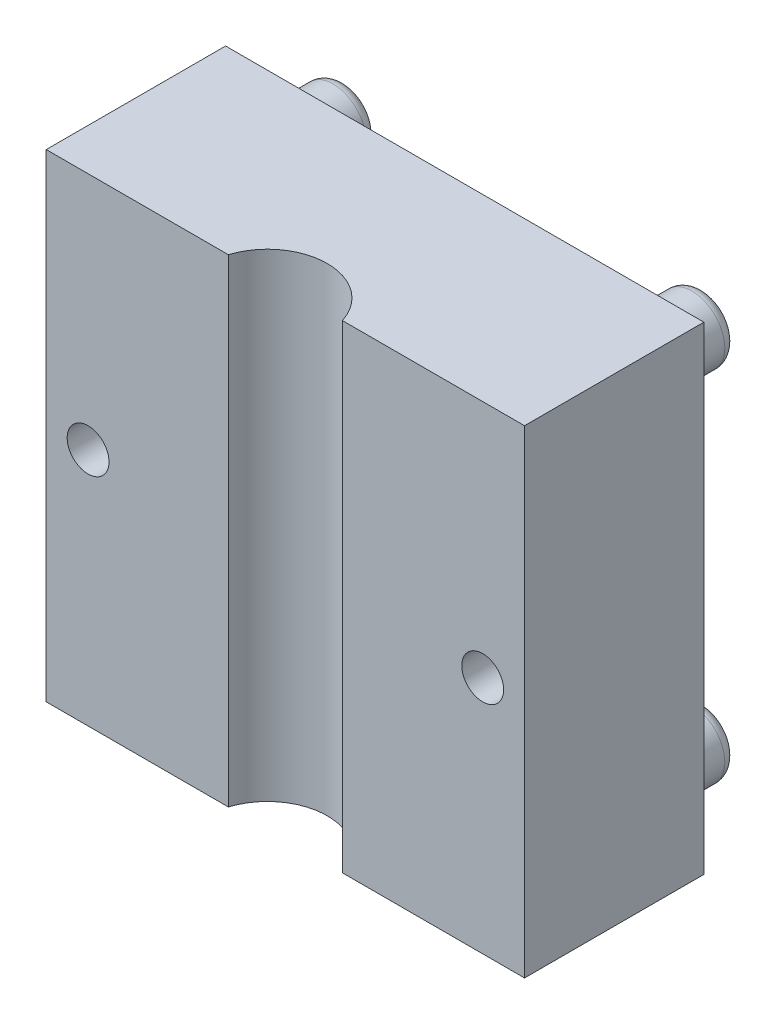
ISO-10303-21;
HEADER;
FILE_DESCRIPTION(('STEP AP214'),'2;1');
FILE_NAME('part.step','',(''),(''),'','','');
FILE_SCHEMA(('AUTOMOTIVE_DESIGN { 1 0 10303 214 1 1 1 1 }'));
ENDSEC;
DATA;
#1=APPLICATION_CONTEXT('core data for automotive mechanical design processes');
#2=APPLICATION_PROTOCOL_DEFINITION('international standard','automotive_design',2000,#1);
#3=PRODUCT_CONTEXT('',#1,'mechanical');
#4=PRODUCT('Part','Part','',(#3));
#5=PRODUCT_RELATED_PRODUCT_CATEGORY('part','',(#4));
#6=PRODUCT_DEFINITION_FORMATION('','',#4);
#7=PRODUCT_DEFINITION_CONTEXT('part definition',#1,'design');
#8=PRODUCT_DEFINITION('design','',#6,#7);
#9=PRODUCT_DEFINITION_SHAPE('','',#8);
#10=(LENGTH_UNIT() NAMED_UNIT(*) SI_UNIT(.MILLI.,.METRE.));
#11=(NAMED_UNIT(*) PLANE_ANGLE_UNIT() SI_UNIT($,.RADIAN.));
#12=(NAMED_UNIT(*) SI_UNIT($,.STERADIAN.) SOLID_ANGLE_UNIT());
#13=UNCERTAINTY_MEASURE_WITH_UNIT(LENGTH_MEASURE(1.E-05),#10,'distance_accuracy_value','');
#14=(GEOMETRIC_REPRESENTATION_CONTEXT(3) GLOBAL_UNCERTAINTY_ASSIGNED_CONTEXT((#13)) GLOBAL_UNIT_ASSIGNED_CONTEXT((#10,
#11,#12)) REPRESENTATION_CONTEXT('',''));
#15=CARTESIAN_POINT('',(0.,0.,0.));
#16=DIRECTION('',(0.,0.,1.));
#17=DIRECTION('',(1.,0.,0.));
#18=AXIS2_PLACEMENT_3D('',#15,#16,#17);
#19=CARTESIAN_POINT('',(0.,0.,15.));
#20=DIRECTION('',(0.,0.,1.));
#21=DIRECTION('',(1.,0.,0.));
#22=AXIS2_PLACEMENT_3D('',#19,#20,#21);
#23=PLANE('',#22);
#24=CARTESIAN_POINT('',(16.5,0.,15.));
#25=DIRECTION('',(0.,0.,-1.));
#26=DIRECTION('',(-1.,0.,0.));
#27=AXIS2_PLACEMENT_3D('',#24,#25,#26);
#28=CIRCLE('',#27,1.75);
#29=CARTESIAN_POINT('',(14.75,0.,15.));
#30=VERTEX_POINT('',#29);
#31=EDGE_CURVE('E184',#30,#30,#28,.T.);
#32=ORIENTED_EDGE('',*,*,#31,.T.);
#33=EDGE_LOOP('',(#32));
#34=FACE_BOUND('',#33,.T.);
#35=DIRECTION('',(0.,1.,0.));
#36=VECTOR('',#35,1.);
#37=CARTESIAN_POINT('',(4.76969600708473,-20.,15.));
#38=LINE('',#37,#36);
#39=CARTESIAN_POINT('',(4.76969600708473,-20.,15.));
#40=VERTEX_POINT('',#39);
#41=CARTESIAN_POINT('',(4.76969600708473,20.,15.));
#42=VERTEX_POINT('',#41);
#43=EDGE_CURVE('E11',#40,#42,#38,.T.);
#44=ORIENTED_EDGE('',*,*,#43,.F.);
#45=DIRECTION('',(1.,0.,0.));
#46=VECTOR('',#45,1.);
#47=CARTESIAN_POINT('',(-20.,-20.,15.));
#48=LINE('',#47,#46);
#49=CARTESIAN_POINT('',(20.,-20.,15.));
#50=VERTEX_POINT('',#49);
#51=EDGE_CURVE('E58',#40,#50,#48,.T.);
#52=ORIENTED_EDGE('',*,*,#51,.T.);
#53=DIRECTION('',(0.,1.,0.));
#54=VECTOR('',#53,1.);
#55=CARTESIAN_POINT('',(20.,20.,15.));
#56=LINE('',#55,#54);
#57=CARTESIAN_POINT('',(20.,20.,15.));
#58=VERTEX_POINT('',#57);
#59=EDGE_CURVE('E105',#50,#58,#56,.T.);
#60=ORIENTED_EDGE('',*,*,#59,.T.);
#61=DIRECTION('',(-1.,0.,0.));
#62=VECTOR('',#61,1.);
#63=CARTESIAN_POINT('',(-20.,20.,15.));
#64=LINE('',#63,#62);
#65=EDGE_CURVE('E87',#58,#42,#64,.T.);
#66=ORIENTED_EDGE('',*,*,#65,.T.);
#67=EDGE_LOOP('',(#44,#52,#60,#66));
#68=FACE_BOUND('',#67,.T.);
#69=ADVANCED_FACE('F33',(#34,#68),#23,.T.);
#70=CARTESIAN_POINT('',(0.,0.,0.));
#71=DIRECTION('',(0.,0.,1.));
#72=DIRECTION('',(1.,0.,0.));
#73=AXIS2_PLACEMENT_3D('',#70,#71,#72);
#74=PLANE('',#73);
#75=CARTESIAN_POINT('',(-16.5,0.,0.));
#76=DIRECTION('',(0.,0.,-1.));
#77=DIRECTION('',(-1.,0.,0.));
#78=AXIS2_PLACEMENT_3D('',#75,#76,#77);
#79=CIRCLE('',#78,3.);
#80=CARTESIAN_POINT('',(-19.5,0.,0.));
#81=VERTEX_POINT('',#80);
#82=EDGE_CURVE('E172',#81,#81,#79,.T.);
#83=ORIENTED_EDGE('',*,*,#82,.F.);
#84=EDGE_LOOP('',(#83));
#85=FACE_BOUND('',#84,.T.);
#86=CARTESIAN_POINT('',(16.5,0.,0.));
#87=DIRECTION('',(0.,0.,-1.));
#88=DIRECTION('',(-1.,0.,0.));
#89=AXIS2_PLACEMENT_3D('',#86,#87,#88);
#90=CIRCLE('',#89,3.);
#91=CARTESIAN_POINT('',(13.5,0.,0.));
#92=VERTEX_POINT('',#91);
#93=EDGE_CURVE('E188',#92,#92,#90,.T.);
#94=ORIENTED_EDGE('',*,*,#93,.F.);
#95=EDGE_LOOP('',(#94));
#96=FACE_BOUND('',#95,.T.);
#97=CARTESIAN_POINT('',(0.,0.,0.));
#98=DIRECTION('',(0.,0.,-1.));
#99=DIRECTION('',(-1.,0.,0.));
#100=AXIS2_PLACEMENT_3D('',#97,#98,#99);
#101=CIRCLE('',#100,12.5);
#102=CARTESIAN_POINT('',(-12.5,0.,0.));
#103=VERTEX_POINT('',#102);
#104=EDGE_CURVE('E194',#103,#103,#101,.T.);
#105=ORIENTED_EDGE('',*,*,#104,.F.);
#106=EDGE_LOOP('',(#105));
#107=FACE_BOUND('',#106,.T.);
#108=CARTESIAN_POINT('',(15.,-15.,0.));
#109=DIRECTION('',(0.,0.,1.));
#110=DIRECTION('',(1.,0.,0.));
#111=AXIS2_PLACEMENT_3D('',#108,#109,#110);
#112=CIRCLE('',#111,2.75);
#113=CARTESIAN_POINT('',(17.75,-15.,0.));
#114=VERTEX_POINT('',#113);
#115=EDGE_CURVE('E140',#114,#114,#112,.F.);
#116=ORIENTED_EDGE('',*,*,#115,.F.);
#117=EDGE_LOOP('',(#116));
#118=FACE_BOUND('',#117,.T.);
#119=CARTESIAN_POINT('',(15.,15.,0.));
#120=DIRECTION('',(0.,0.,1.));
#121=DIRECTION('',(1.,0.,0.));
#122=AXIS2_PLACEMENT_3D('',#119,#120,#121);
#123=CIRCLE('',#122,2.75);
#124=CARTESIAN_POINT('',(17.75,15.,0.));
#125=VERTEX_POINT('',#124);
#126=EDGE_CURVE('E134',#125,#125,#123,.F.);
#127=ORIENTED_EDGE('',*,*,#126,.F.);
#128=EDGE_LOOP('',(#127));
#129=FACE_BOUND('',#128,.T.);
#130=DIRECTION('',(0.,1.,0.));
#131=VECTOR('',#130,1.);
#132=CARTESIAN_POINT('',(20.,20.,0.));
#133=LINE('',#132,#131);
#134=CARTESIAN_POINT('',(20.,-20.,0.));
#135=VERTEX_POINT('',#134);
#136=CARTESIAN_POINT('',(20.,20.,0.));
#137=VERTEX_POINT('',#136);
#138=EDGE_CURVE('E117',#135,#137,#133,.T.);
#139=ORIENTED_EDGE('',*,*,#138,.F.);
#140=DIRECTION('',(1.,0.,0.));
#141=VECTOR('',#140,1.);
#142=CARTESIAN_POINT('',(-20.,-20.,0.));
#143=LINE('',#142,#141);
#144=CARTESIAN_POINT('',(-20.,-20.,0.));
#145=VERTEX_POINT('',#144);
#146=EDGE_CURVE('E80',#145,#135,#143,.T.);
#147=ORIENTED_EDGE('',*,*,#146,.F.);
#148=DIRECTION('',(0.,-1.,0.));
#149=VECTOR('',#148,1.);
#150=CARTESIAN_POINT('',(-20.,20.,0.));
#151=LINE('',#150,#149);
#152=CARTESIAN_POINT('',(-20.,20.,0.));
#153=VERTEX_POINT('',#152);
#154=EDGE_CURVE('E123',#153,#145,#151,.T.);
#155=ORIENTED_EDGE('',*,*,#154,.F.);
#156=DIRECTION('',(-1.,0.,0.));
#157=VECTOR('',#156,1.);
#158=CARTESIAN_POINT('',(-20.,20.,0.));
#159=LINE('',#158,#157);
#160=EDGE_CURVE('E120',#137,#153,#159,.T.);
#161=ORIENTED_EDGE('',*,*,#160,.F.);
#162=EDGE_LOOP('',(#139,#147,#155,#161));
#163=FACE_BOUND('',#162,.T.);
#164=CARTESIAN_POINT('',(-15.,15.,0.));
#165=DIRECTION('',(0.,0.,1.));
#166=DIRECTION('',(1.,0.,0.));
#167=AXIS2_PLACEMENT_3D('',#164,#165,#166);
#168=CIRCLE('',#167,2.75);
#169=CARTESIAN_POINT('',(-12.25,15.,0.));
#170=VERTEX_POINT('',#169);
#171=EDGE_CURVE('E137',#170,#170,#168,.F.);
#172=ORIENTED_EDGE('',*,*,#171,.F.);
#173=EDGE_LOOP('',(#172));
#174=FACE_BOUND('',#173,.T.);
#175=CARTESIAN_POINT('',(-15.,-15.,0.));
#176=DIRECTION('',(0.,0.,1.));
#177=DIRECTION('',(1.,0.,0.));
#178=AXIS2_PLACEMENT_3D('',#175,#176,#177);
#179=CIRCLE('',#178,2.74999999999999);
#180=CARTESIAN_POINT('',(-12.25,-15.,0.));
#181=VERTEX_POINT('',#180);
#182=EDGE_CURVE('E143',#181,#181,#179,.F.);
#183=ORIENTED_EDGE('',*,*,#182,.F.);
#184=EDGE_LOOP('',(#183));
#185=FACE_BOUND('',#184,.T.);
#186=ADVANCED_FACE('F202',(#85,#96,#107,#118,#129,#163,#174,#185),#74,.F.);
#187=CARTESIAN_POINT('',(20.,20.,15.));
#188=DIRECTION('',(-1.,0.,0.));
#189=DIRECTION('',(0.,-1.,0.));
#190=AXIS2_PLACEMENT_3D('',#187,#188,#189);
#191=PLANE('',#190);
#192=ORIENTED_EDGE('',*,*,#138,.T.);
#193=DIRECTION('',(0.,0.,-1.));
#194=VECTOR('',#193,1.);
#195=CARTESIAN_POINT('',(20.,20.,15.));
#196=LINE('',#195,#194);
#197=EDGE_CURVE('E132',#58,#137,#196,.T.);
#198=ORIENTED_EDGE('',*,*,#197,.F.);
#199=ORIENTED_EDGE('',*,*,#59,.F.);
#200=DIRECTION('',(0.,0.,-1.));
#201=VECTOR('',#200,1.);
#202=CARTESIAN_POINT('',(20.,-20.,15.));
#203=LINE('',#202,#201);
#204=EDGE_CURVE('E116',#50,#135,#203,.T.);
#205=ORIENTED_EDGE('',*,*,#204,.T.);
#206=EDGE_LOOP('',(#192,#198,#199,#205));
#207=FACE_BOUND('',#206,.T.);
#208=ADVANCED_FACE('F205',(#207),#191,.F.);
#209=CARTESIAN_POINT('',(-20.,20.,15.));
#210=DIRECTION('',(0.,-1.,0.));
#211=DIRECTION('',(0.,0.,-1.));
#212=AXIS2_PLACEMENT_3D('',#209,#210,#211);
#213=PLANE('',#212);
#214=CARTESIAN_POINT('',(-4.76969600708474,20.,15.));
#215=VERTEX_POINT('',#214);
#216=CARTESIAN_POINT('',(-20.,20.,15.));
#217=VERTEX_POINT('',#216);
#218=EDGE_CURVE('E101',#215,#217,#64,.T.);
#219=ORIENTED_EDGE('',*,*,#218,.F.);
#220=CARTESIAN_POINT('',(0.,20.,16.5));
#221=DIRECTION('',(0.,1.,0.));
#222=DIRECTION('',(0.,0.,1.));
#223=AXIS2_PLACEMENT_3D('',#220,#221,#222);
#224=CIRCLE('',#223,5.);
#225=EDGE_CURVE('E49',#42,#215,#224,.T.);
#226=ORIENTED_EDGE('',*,*,#225,.F.);
#227=ORIENTED_EDGE('',*,*,#65,.F.);
#228=ORIENTED_EDGE('',*,*,#197,.T.);
#229=ORIENTED_EDGE('',*,*,#160,.T.);
#230=DIRECTION('',(0.,0.,-1.));
#231=VECTOR('',#230,1.);
#232=CARTESIAN_POINT('',(-20.,20.,15.));
#233=LINE('',#232,#231);
#234=EDGE_CURVE('E129',#217,#153,#233,.T.);
#235=ORIENTED_EDGE('',*,*,#234,.F.);
#236=EDGE_LOOP('',(#219,#226,#227,#228,#229,#235));
#237=FACE_BOUND('',#236,.T.);
#238=ADVANCED_FACE('F99',(#237),#213,.F.);
#239=CARTESIAN_POINT('',(-20.,20.,15.));
#240=DIRECTION('',(1.,0.,0.));
#241=DIRECTION('',(0.,1.,0.));
#242=AXIS2_PLACEMENT_3D('',#239,#240,#241);
#243=PLANE('',#242);
#244=ORIENTED_EDGE('',*,*,#154,.T.);
#245=DIRECTION('',(0.,0.,-1.));
#246=VECTOR('',#245,1.);
#247=CARTESIAN_POINT('',(-20.,-20.,15.));
#248=LINE('',#247,#246);
#249=CARTESIAN_POINT('',(-20.,-20.,15.));
#250=VERTEX_POINT('',#249);
#251=EDGE_CURVE('E127',#250,#145,#248,.T.);
#252=ORIENTED_EDGE('',*,*,#251,.F.);
#253=DIRECTION('',(0.,-1.,0.));
#254=VECTOR('',#253,1.);
#255=CARTESIAN_POINT('',(-20.,20.,15.));
#256=LINE('',#255,#254);
#257=EDGE_CURVE('E107',#217,#250,#256,.T.);
#258=ORIENTED_EDGE('',*,*,#257,.F.);
#259=ORIENTED_EDGE('',*,*,#234,.T.);
#260=EDGE_LOOP('',(#244,#252,#258,#259));
#261=FACE_BOUND('',#260,.T.);
#262=ADVANCED_FACE('F251',(#261),#243,.F.);
#263=CARTESIAN_POINT('',(-20.,-20.,15.));
#264=DIRECTION('',(0.,1.,0.));
#265=DIRECTION('',(0.,0.,1.));
#266=AXIS2_PLACEMENT_3D('',#263,#264,#265);
#267=PLANE('',#266);
#268=ORIENTED_EDGE('',*,*,#51,.F.);
#269=CARTESIAN_POINT('',(0.,-20.,16.5));
#270=DIRECTION('',(0.,1.,0.));
#271=DIRECTION('',(0.,0.,1.));
#272=AXIS2_PLACEMENT_3D('',#269,#270,#271);
#273=CIRCLE('',#272,5.);
#274=CARTESIAN_POINT('',(-4.76969600708474,-20.,15.));
#275=VERTEX_POINT('',#274);
#276=EDGE_CURVE('E97',#40,#275,#273,.T.);
#277=ORIENTED_EDGE('',*,*,#276,.T.);
#278=EDGE_CURVE('E113',#250,#275,#48,.T.);
#279=ORIENTED_EDGE('',*,*,#278,.F.);
#280=ORIENTED_EDGE('',*,*,#251,.T.);
#281=ORIENTED_EDGE('',*,*,#146,.T.);
#282=ORIENTED_EDGE('',*,*,#204,.F.);
#283=EDGE_LOOP('',(#268,#277,#279,#280,#281,#282));
#284=FACE_BOUND('',#283,.T.);
#285=ADVANCED_FACE('F244',(#284),#267,.F.);
#286=CARTESIAN_POINT('',(-16.5,0.,15.));
#287=DIRECTION('',(0.,0.,-1.));
#288=DIRECTION('',(-1.,0.,0.));
#289=AXIS2_PLACEMENT_3D('',#286,#287,#288);
#290=CIRCLE('',#289,1.75);
#291=CARTESIAN_POINT('',(-18.25,0.,15.));
#292=VERTEX_POINT('',#291);
#293=EDGE_CURVE('E173',#292,#292,#290,.T.);
#294=ORIENTED_EDGE('',*,*,#293,.T.);
#295=EDGE_LOOP('',(#294));
#296=FACE_BOUND('',#295,.T.);
#297=DIRECTION('',(0.,1.,0.));
#298=VECTOR('',#297,1.);
#299=CARTESIAN_POINT('',(-4.76969600708474,-20.,15.));
#300=LINE('',#299,#298);
#301=EDGE_CURVE('E42',#215,#275,#300,.F.);
#302=ORIENTED_EDGE('',*,*,#301,.F.);
#303=ORIENTED_EDGE('',*,*,#218,.T.);
#304=ORIENTED_EDGE('',*,*,#257,.T.);
#305=ORIENTED_EDGE('',*,*,#278,.T.);
#306=EDGE_LOOP('',(#302,#303,#304,#305));
#307=FACE_BOUND('',#306,.T.);
#308=ADVANCED_FACE('F237',(#296,#307),#23,.T.);
#309=CARTESIAN_POINT('',(15.,15.,-5.));
#310=DIRECTION('',(0.,0.,1.));
#311=DIRECTION('',(1.,0.,0.));
#312=AXIS2_PLACEMENT_3D('',#309,#310,#311);
#313=CYLINDRICAL_SURFACE('',#312,2.75);
#314=CARTESIAN_POINT('',(15.,15.,-4.));
#315=DIRECTION('',(0.,0.,-1.));
#316=DIRECTION('',(-1.,0.,0.));
#317=AXIS2_PLACEMENT_3D('',#314,#315,#316);
#318=CIRCLE('',#317,2.75);
#319=CARTESIAN_POINT('',(12.25,15.,-4.));
#320=VERTEX_POINT('',#319);
#321=EDGE_CURVE('E167',#320,#320,#318,.F.);
#322=ORIENTED_EDGE('',*,*,#321,.T.);
#323=EDGE_LOOP('',(#322));
#324=FACE_BOUND('',#323,.T.);
#325=ORIENTED_EDGE('',*,*,#126,.T.);
#326=EDGE_LOOP('',(#325));
#327=FACE_BOUND('',#326,.T.);
#328=ADVANCED_FACE('F243',(#324,#327),#313,.T.);
#329=CARTESIAN_POINT('',(15.,15.,-5.));
#330=DIRECTION('',(0.,0.,-1.));
#331=DIRECTION('',(-1.,0.,0.));
#332=AXIS2_PLACEMENT_3D('',#329,#330,#331);
#333=PLANE('',#332);
#334=CARTESIAN_POINT('',(15.,15.,-5.));
#335=DIRECTION('',(0.,0.,-1.));
#336=DIRECTION('',(-1.,0.,0.));
#337=AXIS2_PLACEMENT_3D('',#334,#335,#336);
#338=CIRCLE('',#337,1.75);
#339=CARTESIAN_POINT('',(13.25,15.,-5.));
#340=VERTEX_POINT('',#339);
#341=EDGE_CURVE('E164',#340,#340,#338,.T.);
#342=ORIENTED_EDGE('',*,*,#341,.T.);
#343=EDGE_LOOP('',(#342));
#344=FACE_BOUND('',#343,.T.);
#345=ADVANCED_FACE('F249',(#344),#333,.T.);
#346=CARTESIAN_POINT('',(-15.,15.,-5.));
#347=DIRECTION('',(0.,0.,1.));
#348=DIRECTION('',(1.,0.,0.));
#349=AXIS2_PLACEMENT_3D('',#346,#347,#348);
#350=CYLINDRICAL_SURFACE('',#349,2.75);
#351=CARTESIAN_POINT('',(-15.,15.,-4.));
#352=DIRECTION('',(0.,0.,-1.));
#353=DIRECTION('',(-1.,0.,0.));
#354=AXIS2_PLACEMENT_3D('',#351,#352,#353);
#355=CIRCLE('',#354,2.75);
#356=CARTESIAN_POINT('',(-17.75,15.,-4.));
#357=VERTEX_POINT('',#356);
#358=EDGE_CURVE('E161',#357,#357,#355,.F.);
#359=ORIENTED_EDGE('',*,*,#358,.T.);
#360=EDGE_LOOP('',(#359));
#361=FACE_BOUND('',#360,.T.);
#362=ORIENTED_EDGE('',*,*,#171,.T.);
#363=EDGE_LOOP('',(#362));
#364=FACE_BOUND('',#363,.T.);
#365=ADVANCED_FACE('F288',(#361,#364),#350,.T.);
#366=CARTESIAN_POINT('',(-15.,15.,-5.));
#367=DIRECTION('',(0.,0.,-1.));
#368=DIRECTION('',(-1.,0.,0.));
#369=AXIS2_PLACEMENT_3D('',#366,#367,#368);
#370=PLANE('',#369);
#371=CARTESIAN_POINT('',(-15.,15.,-5.));
#372=DIRECTION('',(0.,0.,-1.));
#373=DIRECTION('',(-1.,0.,0.));
#374=AXIS2_PLACEMENT_3D('',#371,#372,#373);
#375=CIRCLE('',#374,1.75);
#376=CARTESIAN_POINT('',(-16.75,15.,-5.));
#377=VERTEX_POINT('',#376);
#378=EDGE_CURVE('E158',#377,#377,#375,.T.);
#379=ORIENTED_EDGE('',*,*,#378,.T.);
#380=EDGE_LOOP('',(#379));
#381=FACE_BOUND('',#380,.T.);
#382=ADVANCED_FACE('F286',(#381),#370,.T.);
#383=CARTESIAN_POINT('',(15.,-15.,-5.));
#384=DIRECTION('',(0.,0.,1.));
#385=DIRECTION('',(1.,0.,0.));
#386=AXIS2_PLACEMENT_3D('',#383,#384,#385);
#387=CYLINDRICAL_SURFACE('',#386,2.75);
#388=CARTESIAN_POINT('',(15.,-15.,-4.));
#389=DIRECTION('',(0.,0.,-1.));
#390=DIRECTION('',(-1.,0.,0.));
#391=AXIS2_PLACEMENT_3D('',#388,#389,#390);
#392=CIRCLE('',#391,2.75);
#393=CARTESIAN_POINT('',(12.25,-15.,-4.));
#394=VERTEX_POINT('',#393);
#395=EDGE_CURVE('E149',#394,#394,#392,.F.);
#396=ORIENTED_EDGE('',*,*,#395,.T.);
#397=EDGE_LOOP('',(#396));
#398=FACE_BOUND('',#397,.T.);
#399=ORIENTED_EDGE('',*,*,#115,.T.);
#400=EDGE_LOOP('',(#399));
#401=FACE_BOUND('',#400,.T.);
#402=ADVANCED_FACE('F231',(#398,#401),#387,.T.);
#403=CARTESIAN_POINT('',(15.,-15.,-5.));
#404=DIRECTION('',(0.,0.,-1.));
#405=DIRECTION('',(-1.,0.,0.));
#406=AXIS2_PLACEMENT_3D('',#403,#404,#405);
#407=PLANE('',#406);
#408=CARTESIAN_POINT('',(15.,-15.,-5.));
#409=DIRECTION('',(0.,0.,-1.));
#410=DIRECTION('',(-1.,0.,0.));
#411=AXIS2_PLACEMENT_3D('',#408,#409,#410);
#412=CIRCLE('',#411,1.75);
#413=CARTESIAN_POINT('',(13.25,-15.,-5.));
#414=VERTEX_POINT('',#413);
#415=EDGE_CURVE('E146',#414,#414,#412,.T.);
#416=ORIENTED_EDGE('',*,*,#415,.T.);
#417=EDGE_LOOP('',(#416));
#418=FACE_BOUND('',#417,.T.);
#419=ADVANCED_FACE('F221',(#418),#407,.T.);
#420=CARTESIAN_POINT('',(-15.,-15.,-5.));
#421=DIRECTION('',(0.,0.,1.));
#422=DIRECTION('',(1.,0.,0.));
#423=AXIS2_PLACEMENT_3D('',#420,#421,#422);
#424=CYLINDRICAL_SURFACE('',#423,2.74999999999999);
#425=CARTESIAN_POINT('',(-15.,-15.,-4.));
#426=DIRECTION('',(0.,0.,-1.));
#427=DIRECTION('',(-1.,0.,0.));
#428=AXIS2_PLACEMENT_3D('',#425,#426,#427);
#429=CIRCLE('',#428,2.74999999999999);
#430=CARTESIAN_POINT('',(-17.75,-15.,-4.));
#431=VERTEX_POINT('',#430);
#432=EDGE_CURVE('E155',#431,#431,#429,.F.);
#433=ORIENTED_EDGE('',*,*,#432,.T.);
#434=EDGE_LOOP('',(#433));
#435=FACE_BOUND('',#434,.T.);
#436=ORIENTED_EDGE('',*,*,#182,.T.);
#437=EDGE_LOOP('',(#436));
#438=FACE_BOUND('',#437,.T.);
#439=ADVANCED_FACE('F218',(#435,#438),#424,.T.);
#440=CARTESIAN_POINT('',(-15.,-15.,-5.));
#441=DIRECTION('',(0.,0.,-1.));
#442=DIRECTION('',(-1.,0.,0.));
#443=AXIS2_PLACEMENT_3D('',#440,#441,#442);
#444=PLANE('',#443);
#445=CARTESIAN_POINT('',(-15.,-15.,-5.));
#446=DIRECTION('',(0.,0.,-1.));
#447=DIRECTION('',(-1.,0.,0.));
#448=AXIS2_PLACEMENT_3D('',#445,#446,#447);
#449=CIRCLE('',#448,1.74999999999999);
#450=CARTESIAN_POINT('',(-16.75,-15.,-5.));
#451=VERTEX_POINT('',#450);
#452=EDGE_CURVE('E152',#451,#451,#449,.T.);
#453=ORIENTED_EDGE('',*,*,#452,.T.);
#454=EDGE_LOOP('',(#453));
#455=FACE_BOUND('',#454,.T.);
#456=ADVANCED_FACE('F220',(#455),#444,.T.);
#457=CARTESIAN_POINT('',(15.,-15.,-4.));
#458=DIRECTION('',(0.,0.,-1.));
#459=DIRECTION('',(-1.,0.,0.));
#460=AXIS2_PLACEMENT_3D('',#457,#458,#459);
#461=TOROIDAL_SURFACE('',#460,1.75,1.);
#462=ORIENTED_EDGE('',*,*,#395,.F.);
#463=EDGE_LOOP('',(#462));
#464=FACE_BOUND('',#463,.T.);
#465=ORIENTED_EDGE('',*,*,#415,.F.);
#466=EDGE_LOOP('',(#465));
#467=FACE_BOUND('',#466,.T.);
#468=ADVANCED_FACE('F228',(#464,#467),#461,.T.);
#469=CARTESIAN_POINT('',(-15.,-15.,-4.));
#470=DIRECTION('',(0.,0.,-1.));
#471=DIRECTION('',(-1.,0.,0.));
#472=AXIS2_PLACEMENT_3D('',#469,#470,#471);
#473=TOROIDAL_SURFACE('',#472,1.74999999999999,1.);
#474=ORIENTED_EDGE('',*,*,#432,.F.);
#475=EDGE_LOOP('',(#474));
#476=FACE_BOUND('',#475,.T.);
#477=ORIENTED_EDGE('',*,*,#452,.F.);
#478=EDGE_LOOP('',(#477));
#479=FACE_BOUND('',#478,.T.);
#480=ADVANCED_FACE('F271',(#476,#479),#473,.T.);
#481=CARTESIAN_POINT('',(-15.,15.,-4.));
#482=DIRECTION('',(0.,0.,-1.));
#483=DIRECTION('',(-1.,0.,0.));
#484=AXIS2_PLACEMENT_3D('',#481,#482,#483);
#485=TOROIDAL_SURFACE('',#484,1.75,1.);
#486=ORIENTED_EDGE('',*,*,#358,.F.);
#487=EDGE_LOOP('',(#486));
#488=FACE_BOUND('',#487,.T.);
#489=ORIENTED_EDGE('',*,*,#378,.F.);
#490=EDGE_LOOP('',(#489));
#491=FACE_BOUND('',#490,.T.);
#492=ADVANCED_FACE('F274',(#488,#491),#485,.T.);
#493=CARTESIAN_POINT('',(15.,15.,-4.));
#494=DIRECTION('',(0.,0.,-1.));
#495=DIRECTION('',(-1.,0.,0.));
#496=AXIS2_PLACEMENT_3D('',#493,#494,#495);
#497=TOROIDAL_SURFACE('',#496,1.75,1.);
#498=ORIENTED_EDGE('',*,*,#321,.F.);
#499=EDGE_LOOP('',(#498));
#500=FACE_BOUND('',#499,.T.);
#501=ORIENTED_EDGE('',*,*,#341,.F.);
#502=EDGE_LOOP('',(#501));
#503=FACE_BOUND('',#502,.T.);
#504=ADVANCED_FACE('F35',(#500,#503),#497,.T.);
#505=CARTESIAN_POINT('',(0.,0.,3.5));
#506=DIRECTION('',(0.,0.,-1.));
#507=DIRECTION('',(-1.,0.,0.));
#508=AXIS2_PLACEMENT_3D('',#505,#506,#507);
#509=CYLINDRICAL_SURFACE('',#508,12.5);
#510=CARTESIAN_POINT('',(0.,0.,3.5));
#511=DIRECTION('',(0.,0.,-1.));
#512=DIRECTION('',(-1.,0.,0.));
#513=AXIS2_PLACEMENT_3D('',#510,#511,#512);
#514=CIRCLE('',#513,12.5);
#515=CARTESIAN_POINT('',(-12.5,0.,3.5));
#516=VERTEX_POINT('',#515);
#517=EDGE_CURVE('E121',#516,#516,#514,.T.);
#518=ORIENTED_EDGE('',*,*,#517,.F.);
#519=EDGE_LOOP('',(#518));
#520=FACE_BOUND('',#519,.T.);
#521=ORIENTED_EDGE('',*,*,#104,.T.);
#522=EDGE_LOOP('',(#521));
#523=FACE_BOUND('',#522,.T.);
#524=ADVANCED_FACE('F200',(#520,#523),#509,.F.);
#525=CARTESIAN_POINT('',(0.,0.,3.5));
#526=DIRECTION('',(0.,0.,-1.));
#527=DIRECTION('',(-1.,0.,0.));
#528=AXIS2_PLACEMENT_3D('',#525,#526,#527);
#529=PLANE('',#528);
#530=ORIENTED_EDGE('',*,*,#517,.T.);
#531=EDGE_LOOP('',(#530));
#532=FACE_BOUND('',#531,.T.);
#533=ADVANCED_FACE('F368',(#532),#529,.T.);
#534=CARTESIAN_POINT('',(0.,-20.,16.5));
#535=DIRECTION('',(0.,1.,0.));
#536=DIRECTION('',(0.,0.,1.));
#537=AXIS2_PLACEMENT_3D('',#534,#535,#536);
#538=CYLINDRICAL_SURFACE('',#537,5.);
#539=ORIENTED_EDGE('',*,*,#43,.T.);
#540=ORIENTED_EDGE('',*,*,#225,.T.);
#541=ORIENTED_EDGE('',*,*,#301,.T.);
#542=ORIENTED_EDGE('',*,*,#276,.F.);
#543=EDGE_LOOP('',(#539,#540,#541,#542));
#544=FACE_BOUND('',#543,.T.);
#545=ADVANCED_FACE('F95',(#544),#538,.F.);
#546=CARTESIAN_POINT('',(16.5,0.,2.));
#547=DIRECTION('',(0.,0.,-1.));
#548=DIRECTION('',(-1.,0.,0.));
#549=AXIS2_PLACEMENT_3D('',#546,#547,#548);
#550=CYLINDRICAL_SURFACE('',#549,3.);
#551=CARTESIAN_POINT('',(16.5,0.,2.));
#552=DIRECTION('',(0.,0.,-1.));
#553=DIRECTION('',(-1.,0.,0.));
#554=AXIS2_PLACEMENT_3D('',#551,#552,#553);
#555=CIRCLE('',#554,3.);
#556=CARTESIAN_POINT('',(13.5,0.,2.));
#557=VERTEX_POINT('',#556);
#558=EDGE_CURVE('E102',#557,#557,#555,.T.);
#559=ORIENTED_EDGE('',*,*,#558,.F.);
#560=EDGE_LOOP('',(#559));
#561=FACE_BOUND('',#560,.T.);
#562=ORIENTED_EDGE('',*,*,#93,.T.);
#563=EDGE_LOOP('',(#562));
#564=FACE_BOUND('',#563,.T.);
#565=ADVANCED_FACE('F403',(#561,#564),#550,.F.);
#566=CARTESIAN_POINT('',(16.5,0.,2.));
#567=DIRECTION('',(0.,0.,-1.));
#568=DIRECTION('',(-1.,0.,0.));
#569=AXIS2_PLACEMENT_3D('',#566,#567,#568);
#570=PLANE('',#569);
#571=CARTESIAN_POINT('',(16.5,0.,2.));
#572=DIRECTION('',(0.,0.,-1.));
#573=DIRECTION('',(-1.,0.,0.));
#574=AXIS2_PLACEMENT_3D('',#571,#572,#573);
#575=CIRCLE('',#574,1.75);
#576=CARTESIAN_POINT('',(14.75,0.,2.));
#577=VERTEX_POINT('',#576);
#578=EDGE_CURVE('E37',#577,#577,#575,.T.);
#579=ORIENTED_EDGE('',*,*,#578,.F.);
#580=EDGE_LOOP('',(#579));
#581=FACE_BOUND('',#580,.T.);
#582=ORIENTED_EDGE('',*,*,#558,.T.);
#583=EDGE_LOOP('',(#582));
#584=FACE_BOUND('',#583,.T.);
#585=ADVANCED_FACE('F419',(#581,#584),#570,.T.);
#586=CARTESIAN_POINT('',(-16.5,0.,2.));
#587=DIRECTION('',(0.,0.,-1.));
#588=DIRECTION('',(-1.,0.,0.));
#589=AXIS2_PLACEMENT_3D('',#586,#587,#588);
#590=CYLINDRICAL_SURFACE('',#589,3.);
#591=CARTESIAN_POINT('',(-16.5,0.,2.));
#592=DIRECTION('',(0.,0.,-1.));
#593=DIRECTION('',(-1.,0.,0.));
#594=AXIS2_PLACEMENT_3D('',#591,#592,#593);
#595=CIRCLE('',#594,3.);
#596=CARTESIAN_POINT('',(-19.5,0.,2.));
#597=VERTEX_POINT('',#596);
#598=EDGE_CURVE('E177',#597,#597,#595,.T.);
#599=ORIENTED_EDGE('',*,*,#598,.F.);
#600=EDGE_LOOP('',(#599));
#601=FACE_BOUND('',#600,.T.);
#602=ORIENTED_EDGE('',*,*,#82,.T.);
#603=EDGE_LOOP('',(#602));
#604=FACE_BOUND('',#603,.T.);
#605=ADVANCED_FACE('F427',(#601,#604),#590,.F.);
#606=CARTESIAN_POINT('',(-16.5,0.,2.));
#607=DIRECTION('',(0.,0.,-1.));
#608=DIRECTION('',(-1.,0.,0.));
#609=AXIS2_PLACEMENT_3D('',#606,#607,#608);
#610=PLANE('',#609);
#611=CARTESIAN_POINT('',(-16.5,0.,2.));
#612=DIRECTION('',(0.,0.,-1.));
#613=DIRECTION('',(-1.,0.,0.));
#614=AXIS2_PLACEMENT_3D('',#611,#612,#613);
#615=CIRCLE('',#614,1.75);
#616=CARTESIAN_POINT('',(-18.25,0.,2.));
#617=VERTEX_POINT('',#616);
#618=EDGE_CURVE('E170',#617,#617,#615,.T.);
#619=ORIENTED_EDGE('',*,*,#618,.F.);
#620=EDGE_LOOP('',(#619));
#621=FACE_BOUND('',#620,.T.);
#622=ORIENTED_EDGE('',*,*,#598,.T.);
#623=EDGE_LOOP('',(#622));
#624=FACE_BOUND('',#623,.T.);
#625=ADVANCED_FACE('F431',(#621,#624),#610,.T.);
#626=CARTESIAN_POINT('',(-16.5,0.,15.));
#627=DIRECTION('',(0.,0.,-1.));
#628=DIRECTION('',(-1.,0.,0.));
#629=AXIS2_PLACEMENT_3D('',#626,#627,#628);
#630=CYLINDRICAL_SURFACE('',#629,1.75);
#631=ORIENTED_EDGE('',*,*,#618,.T.);
#632=EDGE_LOOP('',(#631));
#633=FACE_BOUND('',#632,.T.);
#634=ORIENTED_EDGE('',*,*,#293,.F.);
#635=EDGE_LOOP('',(#634));
#636=FACE_BOUND('',#635,.T.);
#637=ADVANCED_FACE('F455',(#633,#636),#630,.F.);
#638=CARTESIAN_POINT('',(16.5,0.,15.));
#639=DIRECTION('',(0.,0.,-1.));
#640=DIRECTION('',(-1.,0.,0.));
#641=AXIS2_PLACEMENT_3D('',#638,#639,#640);
#642=CYLINDRICAL_SURFACE('',#641,1.75);
#643=ORIENTED_EDGE('',*,*,#578,.T.);
#644=EDGE_LOOP('',(#643));
#645=FACE_BOUND('',#644,.T.);
#646=ORIENTED_EDGE('',*,*,#31,.F.);
#647=EDGE_LOOP('',(#646));
#648=FACE_BOUND('',#647,.T.);
#649=ADVANCED_FACE('F465',(#645,#648),#642,.F.);
#650=CLOSED_SHELL('',(#69,#186,#208,#238,#262,#285,#308,#328,#345,#365,#382,#402,#419,#439,#456,
#468,#480,#492,#504,#524,#533,#545,#565,#585,#605,#625,#637,#649));
#651=MANIFOLD_SOLID_BREP('B2',#650);
#652=ADVANCED_BREP_SHAPE_REPRESENTATION('',(#18,#651),#14);
#653=SHAPE_DEFINITION_REPRESENTATION(#9,#652);
ENDSEC;
END-ISO-10303-21;
